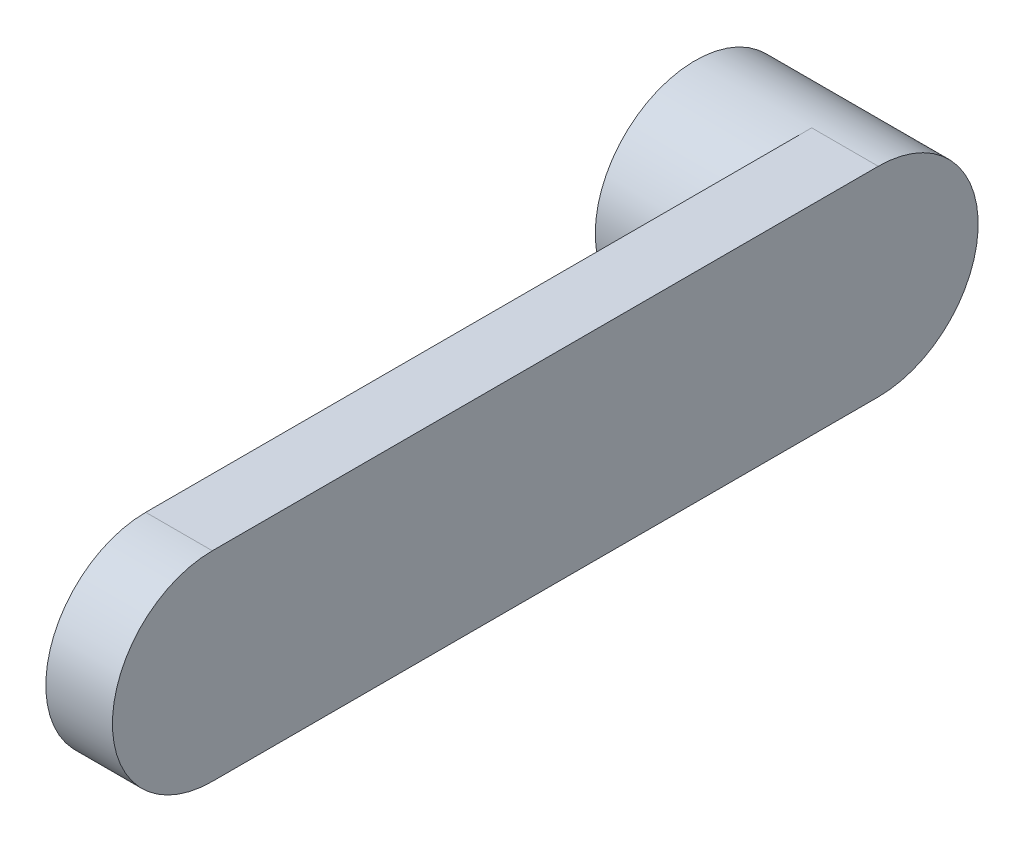
ISO-10303-21;
HEADER;
FILE_DESCRIPTION(('STEP AP214'),'2;1');
FILE_NAME('part.step','',(''),(''),'','','');
FILE_SCHEMA(('AUTOMOTIVE_DESIGN { 1 0 10303 214 1 1 1 1 }'));
ENDSEC;
DATA;
#1=APPLICATION_CONTEXT('core data for automotive mechanical design processes');
#2=APPLICATION_PROTOCOL_DEFINITION('international standard','automotive_design',2000,#1);
#3=PRODUCT_CONTEXT('',#1,'mechanical');
#4=PRODUCT('Part','Part','',(#3));
#5=PRODUCT_RELATED_PRODUCT_CATEGORY('part','',(#4));
#6=PRODUCT_DEFINITION_FORMATION('','',#4);
#7=PRODUCT_DEFINITION_CONTEXT('part definition',#1,'design');
#8=PRODUCT_DEFINITION('design','',#6,#7);
#9=PRODUCT_DEFINITION_SHAPE('','',#8);
#10=(LENGTH_UNIT() NAMED_UNIT(*) SI_UNIT(.MILLI.,.METRE.));
#11=(NAMED_UNIT(*) PLANE_ANGLE_UNIT() SI_UNIT($,.RADIAN.));
#12=(NAMED_UNIT(*) SI_UNIT($,.STERADIAN.) SOLID_ANGLE_UNIT());
#13=UNCERTAINTY_MEASURE_WITH_UNIT(LENGTH_MEASURE(1.E-05),#10,'distance_accuracy_value','');
#14=(GEOMETRIC_REPRESENTATION_CONTEXT(3) GLOBAL_UNCERTAINTY_ASSIGNED_CONTEXT((#13)) GLOBAL_UNIT_ASSIGNED_CONTEXT((#10,
#11,#12)) REPRESENTATION_CONTEXT('',''));
#15=CARTESIAN_POINT('',(0.,0.,0.));
#16=DIRECTION('',(0.,0.,1.));
#17=DIRECTION('',(1.,0.,0.));
#18=AXIS2_PLACEMENT_3D('',#15,#16,#17);
#19=CARTESIAN_POINT('',(20.,0.,0.));
#20=DIRECTION('',(-1.,0.,0.));
#21=DIRECTION('',(0.,0.,1.));
#22=AXIS2_PLACEMENT_3D('',#19,#20,#21);
#23=CYLINDRICAL_SURFACE('',#22,30.);
#24=DIRECTION('',(-1.,0.,0.));
#25=VECTOR('',#24,1.);
#26=CARTESIAN_POINT('',(20.,-30.,0.));
#27=LINE('',#26,#25);
#28=CARTESIAN_POINT('',(20.,-30.,0.));
#29=VERTEX_POINT('',#28);
#30=CARTESIAN_POINT('',(0.,-30.,0.));
#31=VERTEX_POINT('',#30);
#32=EDGE_CURVE('E101',#29,#31,#27,.T.);
#33=ORIENTED_EDGE('',*,*,#32,.T.);
#34=CARTESIAN_POINT('',(0.,0.,0.));
#35=DIRECTION('',(-1.,0.,0.));
#36=DIRECTION('',(0.,0.,1.));
#37=AXIS2_PLACEMENT_3D('',#34,#35,#36);
#38=CIRCLE('',#37,30.);
#39=CARTESIAN_POINT('',(0.,30.,0.));
#40=VERTEX_POINT('',#39);
#41=EDGE_CURVE('E11',#31,#40,#38,.T.);
#42=ORIENTED_EDGE('',*,*,#41,.T.);
#43=DIRECTION('',(-1.,0.,0.));
#44=VECTOR('',#43,1.);
#45=CARTESIAN_POINT('',(20.,30.,0.));
#46=LINE('',#45,#44);
#47=CARTESIAN_POINT('',(20.,30.,0.));
#48=VERTEX_POINT('',#47);
#49=EDGE_CURVE('E42',#48,#40,#46,.T.);
#50=ORIENTED_EDGE('',*,*,#49,.F.);
#51=CARTESIAN_POINT('',(20.,0.,0.));
#52=DIRECTION('',(1.,0.,0.));
#53=DIRECTION('',(0.,0.,1.));
#54=AXIS2_PLACEMENT_3D('',#51,#52,#53);
#55=CIRCLE('',#54,30.);
#56=EDGE_CURVE('E102',#29,#48,#55,.T.);
#57=ORIENTED_EDGE('',*,*,#56,.F.);
#58=EDGE_LOOP('',(#33,#42,#50,#57));
#59=FACE_BOUND('',#58,.T.);
#60=CARTESIAN_POINT('',(-35.,0.,0.));
#61=DIRECTION('',(-1.,0.,0.));
#62=DIRECTION('',(0.,0.,1.));
#63=AXIS2_PLACEMENT_3D('',#60,#61,#62);
#64=CIRCLE('',#63,30.);
#65=CARTESIAN_POINT('',(-35.,0.,30.));
#66=VERTEX_POINT('',#65);
#67=EDGE_CURVE('E97',#66,#66,#64,.T.);
#68=ORIENTED_EDGE('',*,*,#67,.F.);
#69=EDGE_LOOP('',(#68));
#70=FACE_BOUND('',#69,.T.);
#71=ADVANCED_FACE('F39',(#59,#70),#23,.T.);
#72=CARTESIAN_POINT('',(20.,30.,0.));
#73=DIRECTION('',(0.,-1.,0.));
#74=DIRECTION('',(0.,0.,-1.));
#75=AXIS2_PLACEMENT_3D('',#72,#73,#74);
#76=PLANE('',#75);
#77=DIRECTION('',(0.,0.,1.));
#78=VECTOR('',#77,1.);
#79=CARTESIAN_POINT('',(0.,30.,0.));
#80=LINE('',#79,#78);
#81=CARTESIAN_POINT('',(0.,30.,200.));
#82=VERTEX_POINT('',#81);
#83=EDGE_CURVE('E90',#40,#82,#80,.T.);
#84=ORIENTED_EDGE('',*,*,#83,.T.);
#85=DIRECTION('',(-1.,0.,0.));
#86=VECTOR('',#85,1.);
#87=CARTESIAN_POINT('',(20.,30.,200.));
#88=LINE('',#87,#86);
#89=CARTESIAN_POINT('',(20.,30.,200.));
#90=VERTEX_POINT('',#89);
#91=EDGE_CURVE('E94',#90,#82,#88,.T.);
#92=ORIENTED_EDGE('',*,*,#91,.F.);
#93=DIRECTION('',(0.,0.,1.));
#94=VECTOR('',#93,1.);
#95=CARTESIAN_POINT('',(20.,30.,0.));
#96=LINE('',#95,#94);
#97=EDGE_CURVE('E86',#48,#90,#96,.T.);
#98=ORIENTED_EDGE('',*,*,#97,.F.);
#99=ORIENTED_EDGE('',*,*,#49,.T.);
#100=EDGE_LOOP('',(#84,#92,#98,#99));
#101=FACE_BOUND('',#100,.T.);
#102=ADVANCED_FACE('F89',(#101),#76,.F.);
#103=CARTESIAN_POINT('',(20.,0.,200.));
#104=DIRECTION('',(-1.,0.,0.));
#105=DIRECTION('',(0.,0.,1.));
#106=AXIS2_PLACEMENT_3D('',#103,#104,#105);
#107=CYLINDRICAL_SURFACE('',#106,30.);
#108=CARTESIAN_POINT('',(0.,0.,200.));
#109=DIRECTION('',(1.,0.,0.));
#110=DIRECTION('',(0.,0.,-1.));
#111=AXIS2_PLACEMENT_3D('',#108,#109,#110);
#112=CIRCLE('',#111,30.);
#113=CARTESIAN_POINT('',(0.,-30.,200.));
#114=VERTEX_POINT('',#113);
#115=EDGE_CURVE('E72',#82,#114,#112,.T.);
#116=ORIENTED_EDGE('',*,*,#115,.T.);
#117=DIRECTION('',(-1.,0.,0.));
#118=VECTOR('',#117,1.);
#119=CARTESIAN_POINT('',(20.,-30.,200.));
#120=LINE('',#119,#118);
#121=CARTESIAN_POINT('',(20.,-30.,200.));
#122=VERTEX_POINT('',#121);
#123=EDGE_CURVE('E105',#122,#114,#120,.T.);
#124=ORIENTED_EDGE('',*,*,#123,.F.);
#125=CARTESIAN_POINT('',(20.,0.,200.));
#126=DIRECTION('',(1.,0.,0.));
#127=DIRECTION('',(0.,0.,-1.));
#128=AXIS2_PLACEMENT_3D('',#125,#126,#127);
#129=CIRCLE('',#128,30.);
#130=EDGE_CURVE('E110',#90,#122,#129,.T.);
#131=ORIENTED_EDGE('',*,*,#130,.F.);
#132=ORIENTED_EDGE('',*,*,#91,.T.);
#133=EDGE_LOOP('',(#116,#124,#131,#132));
#134=FACE_BOUND('',#133,.T.);
#135=ADVANCED_FACE('F117',(#134),#107,.T.);
#136=CARTESIAN_POINT('',(20.,-30.,0.));
#137=DIRECTION('',(0.,1.,0.));
#138=DIRECTION('',(0.,0.,1.));
#139=AXIS2_PLACEMENT_3D('',#136,#137,#138);
#140=PLANE('',#139);
#141=DIRECTION('',(0.,0.,-1.));
#142=VECTOR('',#141,1.);
#143=CARTESIAN_POINT('',(0.,-30.,0.));
#144=LINE('',#143,#142);
#145=EDGE_CURVE('E113',#114,#31,#144,.T.);
#146=ORIENTED_EDGE('',*,*,#145,.T.);
#147=ORIENTED_EDGE('',*,*,#32,.F.);
#148=DIRECTION('',(0.,0.,-1.));
#149=VECTOR('',#148,1.);
#150=CARTESIAN_POINT('',(20.,-30.,0.));
#151=LINE('',#150,#149);
#152=EDGE_CURVE('E57',#122,#29,#151,.T.);
#153=ORIENTED_EDGE('',*,*,#152,.F.);
#154=ORIENTED_EDGE('',*,*,#123,.T.);
#155=EDGE_LOOP('',(#146,#147,#153,#154));
#156=FACE_BOUND('',#155,.T.);
#157=ADVANCED_FACE('F139',(#156),#140,.F.);
#158=CARTESIAN_POINT('',(20.,0.,0.));
#159=DIRECTION('',(-1.,0.,0.));
#160=DIRECTION('',(0.,0.,1.));
#161=AXIS2_PLACEMENT_3D('',#158,#159,#160);
#162=PLANE('',#161);
#163=ORIENTED_EDGE('',*,*,#56,.T.);
#164=ORIENTED_EDGE('',*,*,#97,.T.);
#165=ORIENTED_EDGE('',*,*,#130,.T.);
#166=ORIENTED_EDGE('',*,*,#152,.T.);
#167=EDGE_LOOP('',(#163,#164,#165,#166));
#168=FACE_BOUND('',#167,.T.);
#169=ADVANCED_FACE('F144',(#168),#162,.F.);
#170=CARTESIAN_POINT('',(0.,0.,0.));
#171=DIRECTION('',(-1.,0.,0.));
#172=DIRECTION('',(0.,0.,1.));
#173=AXIS2_PLACEMENT_3D('',#170,#171,#172);
#174=PLANE('',#173);
#175=ORIENTED_EDGE('',*,*,#41,.F.);
#176=ORIENTED_EDGE('',*,*,#145,.F.);
#177=ORIENTED_EDGE('',*,*,#115,.F.);
#178=ORIENTED_EDGE('',*,*,#83,.F.);
#179=EDGE_LOOP('',(#175,#176,#177,#178));
#180=FACE_BOUND('',#179,.T.);
#181=ADVANCED_FACE('F95',(#180),#174,.T.);
#182=CARTESIAN_POINT('',(-35.,0.,0.));
#183=DIRECTION('',(-1.,0.,0.));
#184=DIRECTION('',(0.,0.,1.));
#185=AXIS2_PLACEMENT_3D('',#182,#183,#184);
#186=PLANE('',#185);
#187=ORIENTED_EDGE('',*,*,#67,.T.);
#188=EDGE_LOOP('',(#187));
#189=FACE_BOUND('',#188,.T.);
#190=ADVANCED_FACE('F131',(#189),#186,.T.);
#191=CLOSED_SHELL('',(#71,#102,#135,#157,#169,#181,#190));
#192=MANIFOLD_SOLID_BREP('B2',#191);
#193=ADVANCED_BREP_SHAPE_REPRESENTATION('',(#18,#192),#14);
#194=SHAPE_DEFINITION_REPRESENTATION(#9,#193);
ENDSEC;
END-ISO-10303-21;
